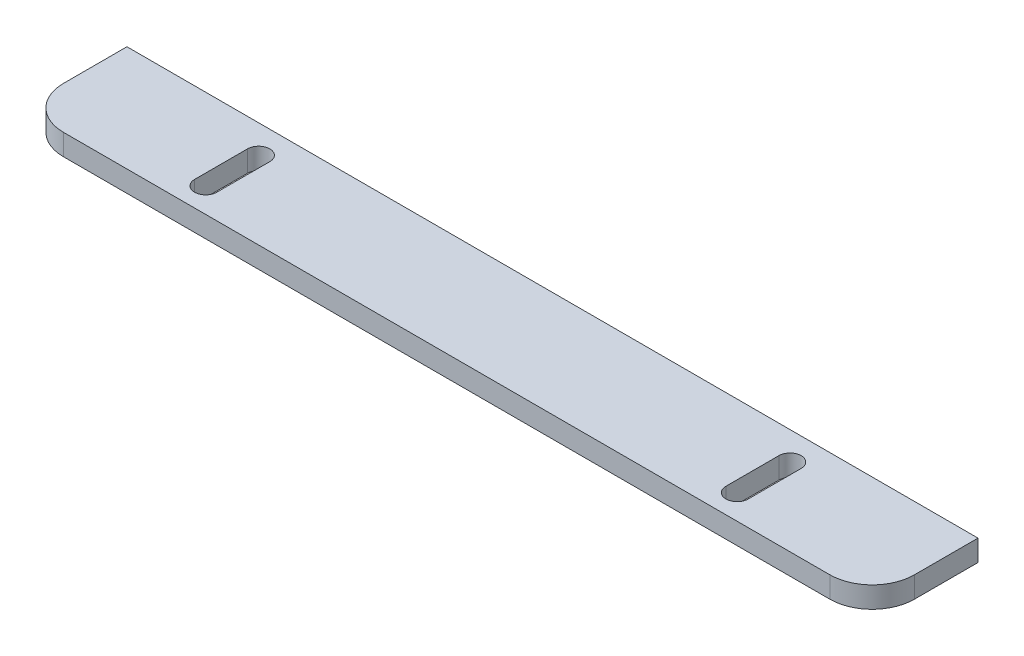
ISO-10303-21;
HEADER;
FILE_DESCRIPTION(('STEP AP214'),'2;1');
FILE_NAME('part.step','',(''),(''),'','','');
FILE_SCHEMA(('AUTOMOTIVE_DESIGN { 1 0 10303 214 1 1 1 1 }'));
ENDSEC;
DATA;
#1=APPLICATION_CONTEXT('core data for automotive mechanical design processes');
#2=APPLICATION_PROTOCOL_DEFINITION('international standard','automotive_design',2000,#1);
#3=PRODUCT_CONTEXT('',#1,'mechanical');
#4=PRODUCT('Part','Part','',(#3));
#5=PRODUCT_RELATED_PRODUCT_CATEGORY('part','',(#4));
#6=PRODUCT_DEFINITION_FORMATION('','',#4);
#7=PRODUCT_DEFINITION_CONTEXT('part definition',#1,'design');
#8=PRODUCT_DEFINITION('design','',#6,#7);
#9=PRODUCT_DEFINITION_SHAPE('','',#8);
#10=(LENGTH_UNIT() NAMED_UNIT(*) SI_UNIT(.MILLI.,.METRE.));
#11=(NAMED_UNIT(*) PLANE_ANGLE_UNIT() SI_UNIT($,.RADIAN.));
#12=(NAMED_UNIT(*) SI_UNIT($,.STERADIAN.) SOLID_ANGLE_UNIT());
#13=UNCERTAINTY_MEASURE_WITH_UNIT(LENGTH_MEASURE(1.E-05),#10,'distance_accuracy_value','');
#14=(GEOMETRIC_REPRESENTATION_CONTEXT(3) GLOBAL_UNCERTAINTY_ASSIGNED_CONTEXT((#13)) GLOBAL_UNIT_ASSIGNED_CONTEXT((#10,
#11,#12)) REPRESENTATION_CONTEXT('',''));
#15=CARTESIAN_POINT('',(0.,0.,0.));
#16=DIRECTION('',(0.,0.,1.));
#17=DIRECTION('',(1.,0.,0.));
#18=AXIS2_PLACEMENT_3D('',#15,#16,#17);
#19=CARTESIAN_POINT('',(10.,5.,-10.));
#20=DIRECTION('',(0.,-1.,0.));
#21=DIRECTION('',(0.,0.,-1.));
#22=AXIS2_PLACEMENT_3D('',#19,#20,#21);
#23=PLANE('',#22);
#24=CARTESIAN_POINT('',(37.75,5.,-18.3595406360424));
#25=DIRECTION('',(0.,1.,0.));
#26=DIRECTION('',(0.,0.,1.));
#27=AXIS2_PLACEMENT_3D('',#24,#25,#26);
#28=CIRCLE('',#27,2.62500000000001);
#29=CARTESIAN_POINT('',(40.375,5.,-18.3595406360424));
#30=VERTEX_POINT('',#29);
#31=CARTESIAN_POINT('',(35.125,5.,-18.3595406360424));
#32=VERTEX_POINT('',#31);
#33=EDGE_CURVE('E170',#30,#32,#28,.T.);
#34=ORIENTED_EDGE('',*,*,#33,.F.);
#35=DIRECTION('',(0.,0.,-1.));
#36=VECTOR('',#35,1.);
#37=CARTESIAN_POINT('',(40.375,5.,-18.3595406360424));
#38=LINE('',#37,#36);
#39=CARTESIAN_POINT('',(40.375,5.,-5.85954063604238));
#40=VERTEX_POINT('',#39);
#41=EDGE_CURVE('E178',#40,#30,#38,.T.);
#42=ORIENTED_EDGE('',*,*,#41,.F.);
#43=CARTESIAN_POINT('',(37.75,5.,-5.85954063604238));
#44=DIRECTION('',(0.,1.,0.));
#45=DIRECTION('',(0.,0.,1.));
#46=AXIS2_PLACEMENT_3D('',#43,#44,#45);
#47=CIRCLE('',#46,2.625);
#48=CARTESIAN_POINT('',(35.125,5.,-5.85954063604238));
#49=VERTEX_POINT('',#48);
#50=EDGE_CURVE('E175',#49,#40,#47,.T.);
#51=ORIENTED_EDGE('',*,*,#50,.F.);
#52=DIRECTION('',(0.,0.,1.));
#53=VECTOR('',#52,1.);
#54=CARTESIAN_POINT('',(35.125,5.,-18.3595406360424));
#55=LINE('',#54,#53);
#56=EDGE_CURVE('E172',#32,#49,#55,.T.);
#57=ORIENTED_EDGE('',*,*,#56,.F.);
#58=EDGE_LOOP('',(#34,#42,#51,#57));
#59=FACE_BOUND('',#58,.T.);
#60=DIRECTION('',(0.,0.,-1.));
#61=VECTOR('',#60,1.);
#62=CARTESIAN_POINT('',(201.,5.,-10.));
#63=LINE('',#62,#61);
#64=CARTESIAN_POINT('',(201.,5.,-10.));
#65=VERTEX_POINT('',#64);
#66=CARTESIAN_POINT('',(201.,5.,-25.));
#67=VERTEX_POINT('',#66);
#68=EDGE_CURVE('E201',#65,#67,#63,.T.);
#69=ORIENTED_EDGE('',*,*,#68,.T.);
#70=DIRECTION('',(-1.,0.,0.));
#71=VECTOR('',#70,1.);
#72=CARTESIAN_POINT('',(0.,5.,-25.));
#73=LINE('',#72,#71);
#74=CARTESIAN_POINT('',(0.,5.,-25.));
#75=VERTEX_POINT('',#74);
#76=EDGE_CURVE('E204',#67,#75,#73,.T.);
#77=ORIENTED_EDGE('',*,*,#76,.T.);
#78=DIRECTION('',(0.,0.,1.));
#79=VECTOR('',#78,1.);
#80=CARTESIAN_POINT('',(0.,5.,-10.));
#81=LINE('',#80,#79);
#82=CARTESIAN_POINT('',(0.,5.,-10.));
#83=VERTEX_POINT('',#82);
#84=EDGE_CURVE('E207',#75,#83,#81,.T.);
#85=ORIENTED_EDGE('',*,*,#84,.T.);
#86=CARTESIAN_POINT('',(10.,5.,-10.));
#87=DIRECTION('',(0.,1.,0.));
#88=DIRECTION('',(0.,0.,-1.));
#89=AXIS2_PLACEMENT_3D('',#86,#87,#88);
#90=CIRCLE('',#89,10.);
#91=CARTESIAN_POINT('',(10.,5.,0.));
#92=VERTEX_POINT('',#91);
#93=EDGE_CURVE('E209',#83,#92,#90,.T.);
#94=ORIENTED_EDGE('',*,*,#93,.T.);
#95=DIRECTION('',(1.,0.,0.));
#96=VECTOR('',#95,1.);
#97=CARTESIAN_POINT('',(10.,5.,0.));
#98=LINE('',#97,#96);
#99=CARTESIAN_POINT('',(191.,5.,0.));
#100=VERTEX_POINT('',#99);
#101=EDGE_CURVE('E211',#92,#100,#98,.T.);
#102=ORIENTED_EDGE('',*,*,#101,.T.);
#103=CARTESIAN_POINT('',(191.,5.,-10.));
#104=DIRECTION('',(0.,1.,0.));
#105=DIRECTION('',(0.,0.,1.));
#106=AXIS2_PLACEMENT_3D('',#103,#104,#105);
#107=CIRCLE('',#106,9.99999999999999);
#108=EDGE_CURVE('E213',#100,#65,#107,.T.);
#109=ORIENTED_EDGE('',*,*,#108,.T.);
#110=EDGE_LOOP('',(#69,#77,#85,#94,#102,#109));
#111=FACE_BOUND('',#110,.T.);
#112=CARTESIAN_POINT('',(163.25,5.,-18.3595406360424));
#113=DIRECTION('',(0.,1.,0.));
#114=DIRECTION('',(0.,0.,-1.));
#115=AXIS2_PLACEMENT_3D('',#112,#113,#114);
#116=CIRCLE('',#115,2.62500000000002);
#117=CARTESIAN_POINT('',(165.875,5.,-18.3595406360424));
#118=VERTEX_POINT('',#117);
#119=CARTESIAN_POINT('',(160.625,5.,-18.3595406360424));
#120=VERTEX_POINT('',#119);
#121=EDGE_CURVE('E134',#118,#120,#116,.T.);
#122=ORIENTED_EDGE('',*,*,#121,.F.);
#123=DIRECTION('',(0.,0.,-1.));
#124=VECTOR('',#123,1.);
#125=CARTESIAN_POINT('',(165.875,5.,-18.3595406360424));
#126=LINE('',#125,#124);
#127=CARTESIAN_POINT('',(165.875,5.,-5.85954063604238));
#128=VERTEX_POINT('',#127);
#129=EDGE_CURVE('E156',#128,#118,#126,.T.);
#130=ORIENTED_EDGE('',*,*,#129,.F.);
#131=CARTESIAN_POINT('',(163.25,5.,-5.85954063604238));
#132=DIRECTION('',(0.,1.,0.));
#133=DIRECTION('',(0.,0.,-1.));
#134=AXIS2_PLACEMENT_3D('',#131,#132,#133);
#135=CIRCLE('',#134,2.62499999999999);
#136=CARTESIAN_POINT('',(160.625,5.,-5.85954063604238));
#137=VERTEX_POINT('',#136);
#138=EDGE_CURVE('E154',#137,#128,#135,.T.);
#139=ORIENTED_EDGE('',*,*,#138,.F.);
#140=DIRECTION('',(0.,0.,1.));
#141=VECTOR('',#140,1.);
#142=CARTESIAN_POINT('',(160.625,5.,-18.3595406360424));
#143=LINE('',#142,#141);
#144=EDGE_CURVE('E142',#120,#137,#143,.T.);
#145=ORIENTED_EDGE('',*,*,#144,.F.);
#146=EDGE_LOOP('',(#122,#130,#139,#145));
#147=FACE_BOUND('',#146,.T.);
#148=ADVANCED_FACE('F33',(#59,#111,#147),#23,.F.);
#149=CARTESIAN_POINT('',(10.,0.,-10.));
#150=DIRECTION('',(0.,-1.,0.));
#151=DIRECTION('',(0.,0.,-1.));
#152=AXIS2_PLACEMENT_3D('',#149,#150,#151);
#153=PLANE('',#152);
#154=DIRECTION('',(0.,0.,-1.));
#155=VECTOR('',#154,1.);
#156=CARTESIAN_POINT('',(40.375,0.,-18.3595406360424));
#157=LINE('',#156,#155);
#158=CARTESIAN_POINT('',(40.375,0.,-5.85954063604238));
#159=VERTEX_POINT('',#158);
#160=CARTESIAN_POINT('',(40.375,0.,-18.3595406360424));
#161=VERTEX_POINT('',#160);
#162=EDGE_CURVE('E173',#159,#161,#157,.T.);
#163=ORIENTED_EDGE('',*,*,#162,.T.);
#164=CARTESIAN_POINT('',(37.75,0.,-18.3595406360424));
#165=DIRECTION('',(0.,1.,0.));
#166=DIRECTION('',(0.,0.,1.));
#167=AXIS2_PLACEMENT_3D('',#164,#165,#166);
#168=CIRCLE('',#167,2.62500000000001);
#169=CARTESIAN_POINT('',(35.125,0.,-18.3595406360424));
#170=VERTEX_POINT('',#169);
#171=EDGE_CURVE('E150',#161,#170,#168,.T.);
#172=ORIENTED_EDGE('',*,*,#171,.T.);
#173=DIRECTION('',(0.,0.,1.));
#174=VECTOR('',#173,1.);
#175=CARTESIAN_POINT('',(35.125,0.,-18.3595406360424));
#176=LINE('',#175,#174);
#177=CARTESIAN_POINT('',(35.125,0.,-5.85954063604238));
#178=VERTEX_POINT('',#177);
#179=EDGE_CURVE('E183',#170,#178,#176,.T.);
#180=ORIENTED_EDGE('',*,*,#179,.T.);
#181=CARTESIAN_POINT('',(37.75,0.,-5.85954063604238));
#182=DIRECTION('',(0.,1.,0.));
#183=DIRECTION('',(0.,0.,1.));
#184=AXIS2_PLACEMENT_3D('',#181,#182,#183);
#185=CIRCLE('',#184,2.625);
#186=EDGE_CURVE('E186',#178,#159,#185,.T.);
#187=ORIENTED_EDGE('',*,*,#186,.T.);
#188=EDGE_LOOP('',(#163,#172,#180,#187));
#189=FACE_BOUND('',#188,.T.);
#190=DIRECTION('',(0.,0.,-1.));
#191=VECTOR('',#190,1.);
#192=CARTESIAN_POINT('',(201.,0.,-10.));
#193=LINE('',#192,#191);
#194=CARTESIAN_POINT('',(201.,0.,-10.));
#195=VERTEX_POINT('',#194);
#196=CARTESIAN_POINT('',(201.,0.,-25.));
#197=VERTEX_POINT('',#196);
#198=EDGE_CURVE('E200',#195,#197,#193,.T.);
#199=ORIENTED_EDGE('',*,*,#198,.F.);
#200=CARTESIAN_POINT('',(191.,0.,-10.));
#201=DIRECTION('',(0.,1.,0.));
#202=DIRECTION('',(0.,0.,1.));
#203=AXIS2_PLACEMENT_3D('',#200,#201,#202);
#204=CIRCLE('',#203,9.99999999999999);
#205=CARTESIAN_POINT('',(191.,0.,0.));
#206=VERTEX_POINT('',#205);
#207=EDGE_CURVE('E205',#206,#195,#204,.T.);
#208=ORIENTED_EDGE('',*,*,#207,.F.);
#209=DIRECTION('',(1.,0.,0.));
#210=VECTOR('',#209,1.);
#211=CARTESIAN_POINT('',(10.,0.,0.));
#212=LINE('',#211,#210);
#213=CARTESIAN_POINT('',(10.,0.,0.));
#214=VERTEX_POINT('',#213);
#215=EDGE_CURVE('E224',#214,#206,#212,.T.);
#216=ORIENTED_EDGE('',*,*,#215,.F.);
#217=CARTESIAN_POINT('',(10.,0.,-10.));
#218=DIRECTION('',(0.,1.,0.));
#219=DIRECTION('',(0.,0.,-1.));
#220=AXIS2_PLACEMENT_3D('',#217,#218,#219);
#221=CIRCLE('',#220,10.);
#222=CARTESIAN_POINT('',(0.,0.,-10.));
#223=VERTEX_POINT('',#222);
#224=EDGE_CURVE('E222',#223,#214,#221,.T.);
#225=ORIENTED_EDGE('',*,*,#224,.F.);
#226=DIRECTION('',(0.,0.,1.));
#227=VECTOR('',#226,1.);
#228=CARTESIAN_POINT('',(0.,0.,-10.));
#229=LINE('',#228,#227);
#230=CARTESIAN_POINT('',(0.,0.,-25.));
#231=VERTEX_POINT('',#230);
#232=EDGE_CURVE('E220',#231,#223,#229,.T.);
#233=ORIENTED_EDGE('',*,*,#232,.F.);
#234=DIRECTION('',(-1.,0.,0.));
#235=VECTOR('',#234,1.);
#236=CARTESIAN_POINT('',(0.,0.,-25.));
#237=LINE('',#236,#235);
#238=EDGE_CURVE('E218',#197,#231,#237,.T.);
#239=ORIENTED_EDGE('',*,*,#238,.F.);
#240=EDGE_LOOP('',(#199,#208,#216,#225,#233,#239));
#241=FACE_BOUND('',#240,.T.);
#242=DIRECTION('',(0.,0.,-1.));
#243=VECTOR('',#242,1.);
#244=CARTESIAN_POINT('',(165.875,0.,-18.3595406360424));
#245=LINE('',#244,#243);
#246=CARTESIAN_POINT('',(165.875,0.,-5.85954063604238));
#247=VERTEX_POINT('',#246);
#248=CARTESIAN_POINT('',(165.875,0.,-18.3595406360424));
#249=VERTEX_POINT('',#248);
#250=EDGE_CURVE('E143',#247,#249,#245,.T.);
#251=ORIENTED_EDGE('',*,*,#250,.T.);
#252=CARTESIAN_POINT('',(163.25,0.,-18.3595406360424));
#253=DIRECTION('',(0.,1.,0.));
#254=DIRECTION('',(0.,0.,-1.));
#255=AXIS2_PLACEMENT_3D('',#252,#253,#254);
#256=CIRCLE('',#255,2.62500000000002);
#257=CARTESIAN_POINT('',(160.625,0.,-18.3595406360424));
#258=VERTEX_POINT('',#257);
#259=EDGE_CURVE('E56',#249,#258,#256,.T.);
#260=ORIENTED_EDGE('',*,*,#259,.T.);
#261=DIRECTION('',(0.,0.,1.));
#262=VECTOR('',#261,1.);
#263=CARTESIAN_POINT('',(160.625,0.,-18.3595406360424));
#264=LINE('',#263,#262);
#265=CARTESIAN_POINT('',(160.625,0.,-5.85954063604238));
#266=VERTEX_POINT('',#265);
#267=EDGE_CURVE('E149',#258,#266,#264,.T.);
#268=ORIENTED_EDGE('',*,*,#267,.T.);
#269=CARTESIAN_POINT('',(163.25,0.,-5.85954063604238));
#270=DIRECTION('',(0.,1.,0.));
#271=DIRECTION('',(0.,0.,-1.));
#272=AXIS2_PLACEMENT_3D('',#269,#270,#271);
#273=CIRCLE('',#272,2.62499999999999);
#274=EDGE_CURVE('E162',#266,#247,#273,.T.);
#275=ORIENTED_EDGE('',*,*,#274,.T.);
#276=EDGE_LOOP('',(#251,#260,#268,#275));
#277=FACE_BOUND('',#276,.T.);
#278=ADVANCED_FACE('F248',(#189,#241,#277),#153,.T.);
#279=CARTESIAN_POINT('',(201.,5.,-10.));
#280=DIRECTION('',(-1.,0.,0.));
#281=DIRECTION('',(0.,0.,1.));
#282=AXIS2_PLACEMENT_3D('',#279,#280,#281);
#283=PLANE('',#282);
#284=ORIENTED_EDGE('',*,*,#198,.T.);
#285=DIRECTION('',(0.,-1.,0.));
#286=VECTOR('',#285,1.);
#287=CARTESIAN_POINT('',(201.,5.,-25.));
#288=LINE('',#287,#286);
#289=EDGE_CURVE('E11',#67,#197,#288,.T.);
#290=ORIENTED_EDGE('',*,*,#289,.F.);
#291=ORIENTED_EDGE('',*,*,#68,.F.);
#292=DIRECTION('',(0.,-1.,0.));
#293=VECTOR('',#292,1.);
#294=CARTESIAN_POINT('',(201.,5.,-10.));
#295=LINE('',#294,#293);
#296=EDGE_CURVE('E215',#65,#195,#295,.T.);
#297=ORIENTED_EDGE('',*,*,#296,.T.);
#298=EDGE_LOOP('',(#284,#290,#291,#297));
#299=FACE_BOUND('',#298,.T.);
#300=ADVANCED_FACE('F35',(#299),#283,.F.);
#301=CARTESIAN_POINT('',(0.,5.,-25.));
#302=DIRECTION('',(0.,0.,1.));
#303=DIRECTION('',(1.,0.,0.));
#304=AXIS2_PLACEMENT_3D('',#301,#302,#303);
#305=PLANE('',#304);
#306=ORIENTED_EDGE('',*,*,#238,.T.);
#307=DIRECTION('',(0.,-1.,0.));
#308=VECTOR('',#307,1.);
#309=CARTESIAN_POINT('',(0.,5.,-25.));
#310=LINE('',#309,#308);
#311=EDGE_CURVE('E41',#75,#231,#310,.T.);
#312=ORIENTED_EDGE('',*,*,#311,.F.);
#313=ORIENTED_EDGE('',*,*,#76,.F.);
#314=ORIENTED_EDGE('',*,*,#289,.T.);
#315=EDGE_LOOP('',(#306,#312,#313,#314));
#316=FACE_BOUND('',#315,.T.);
#317=ADVANCED_FACE('F265',(#316),#305,.F.);
#318=CARTESIAN_POINT('',(0.,5.,-10.));
#319=DIRECTION('',(1.,0.,0.));
#320=DIRECTION('',(0.,0.,-1.));
#321=AXIS2_PLACEMENT_3D('',#318,#319,#320);
#322=PLANE('',#321);
#323=ORIENTED_EDGE('',*,*,#232,.T.);
#324=DIRECTION('',(0.,-1.,0.));
#325=VECTOR('',#324,1.);
#326=CARTESIAN_POINT('',(0.,5.,-10.));
#327=LINE('',#326,#325);
#328=EDGE_CURVE('E235',#83,#223,#327,.T.);
#329=ORIENTED_EDGE('',*,*,#328,.F.);
#330=ORIENTED_EDGE('',*,*,#84,.F.);
#331=ORIENTED_EDGE('',*,*,#311,.T.);
#332=EDGE_LOOP('',(#323,#329,#330,#331));
#333=FACE_BOUND('',#332,.T.);
#334=ADVANCED_FACE('F242',(#333),#322,.F.);
#335=CARTESIAN_POINT('',(10.,5.,-10.));
#336=DIRECTION('',(0.,-1.,0.));
#337=DIRECTION('',(0.,0.,-1.));
#338=AXIS2_PLACEMENT_3D('',#335,#336,#337);
#339=CYLINDRICAL_SURFACE('',#338,10.);
#340=ORIENTED_EDGE('',*,*,#224,.T.);
#341=DIRECTION('',(0.,-1.,0.));
#342=VECTOR('',#341,1.);
#343=CARTESIAN_POINT('',(10.,5.,0.));
#344=LINE('',#343,#342);
#345=EDGE_CURVE('E232',#92,#214,#344,.T.);
#346=ORIENTED_EDGE('',*,*,#345,.F.);
#347=ORIENTED_EDGE('',*,*,#93,.F.);
#348=ORIENTED_EDGE('',*,*,#328,.T.);
#349=EDGE_LOOP('',(#340,#346,#347,#348));
#350=FACE_BOUND('',#349,.T.);
#351=ADVANCED_FACE('F254',(#350),#339,.T.);
#352=CARTESIAN_POINT('',(10.,5.,0.));
#353=DIRECTION('',(0.,0.,-1.));
#354=DIRECTION('',(-1.,0.,0.));
#355=AXIS2_PLACEMENT_3D('',#352,#353,#354);
#356=PLANE('',#355);
#357=ORIENTED_EDGE('',*,*,#215,.T.);
#358=DIRECTION('',(0.,-1.,0.));
#359=VECTOR('',#358,1.);
#360=CARTESIAN_POINT('',(191.,5.,0.));
#361=LINE('',#360,#359);
#362=EDGE_CURVE('E229',#100,#206,#361,.T.);
#363=ORIENTED_EDGE('',*,*,#362,.F.);
#364=ORIENTED_EDGE('',*,*,#101,.F.);
#365=ORIENTED_EDGE('',*,*,#345,.T.);
#366=EDGE_LOOP('',(#357,#363,#364,#365));
#367=FACE_BOUND('',#366,.T.);
#368=ADVANCED_FACE('F258',(#367),#356,.F.);
#369=CARTESIAN_POINT('',(191.,5.,-10.));
#370=DIRECTION('',(0.,-1.,0.));
#371=DIRECTION('',(0.,0.,-1.));
#372=AXIS2_PLACEMENT_3D('',#369,#370,#371);
#373=CYLINDRICAL_SURFACE('',#372,9.99999999999999);
#374=ORIENTED_EDGE('',*,*,#207,.T.);
#375=ORIENTED_EDGE('',*,*,#296,.F.);
#376=ORIENTED_EDGE('',*,*,#108,.F.);
#377=ORIENTED_EDGE('',*,*,#362,.T.);
#378=EDGE_LOOP('',(#374,#375,#376,#377));
#379=FACE_BOUND('',#378,.T.);
#380=ADVANCED_FACE('F268',(#379),#373,.T.);
#381=CARTESIAN_POINT('',(37.75,5.,-18.3595406360424));
#382=DIRECTION('',(0.,-1.,0.));
#383=DIRECTION('',(0.,0.,-1.));
#384=AXIS2_PLACEMENT_3D('',#381,#382,#383);
#385=CYLINDRICAL_SURFACE('',#384,2.62500000000001);
#386=ORIENTED_EDGE('',*,*,#171,.F.);
#387=DIRECTION('',(0.,-1.,0.));
#388=VECTOR('',#387,1.);
#389=CARTESIAN_POINT('',(40.375,5.,-18.3595406360424));
#390=LINE('',#389,#388);
#391=EDGE_CURVE('E180',#30,#161,#390,.T.);
#392=ORIENTED_EDGE('',*,*,#391,.F.);
#393=ORIENTED_EDGE('',*,*,#33,.T.);
#394=DIRECTION('',(0.,-1.,0.));
#395=VECTOR('',#394,1.);
#396=CARTESIAN_POINT('',(35.125,5.,-18.3595406360424));
#397=LINE('',#396,#395);
#398=EDGE_CURVE('E197',#32,#170,#397,.T.);
#399=ORIENTED_EDGE('',*,*,#398,.T.);
#400=EDGE_LOOP('',(#386,#392,#393,#399));
#401=FACE_BOUND('',#400,.T.);
#402=ADVANCED_FACE('F270',(#401),#385,.F.);
#403=CARTESIAN_POINT('',(35.125,5.,-18.3595406360424));
#404=DIRECTION('',(1.,0.,0.));
#405=DIRECTION('',(0.,0.,-1.));
#406=AXIS2_PLACEMENT_3D('',#403,#404,#405);
#407=PLANE('',#406);
#408=ORIENTED_EDGE('',*,*,#179,.F.);
#409=ORIENTED_EDGE('',*,*,#398,.F.);
#410=ORIENTED_EDGE('',*,*,#56,.T.);
#411=DIRECTION('',(0.,-1.,0.));
#412=VECTOR('',#411,1.);
#413=CARTESIAN_POINT('',(35.125,5.,-5.85954063604238));
#414=LINE('',#413,#412);
#415=EDGE_CURVE('E195',#49,#178,#414,.T.);
#416=ORIENTED_EDGE('',*,*,#415,.T.);
#417=EDGE_LOOP('',(#408,#409,#410,#416));
#418=FACE_BOUND('',#417,.T.);
#419=ADVANCED_FACE('F276',(#418),#407,.T.);
#420=CARTESIAN_POINT('',(37.75,5.,-5.85954063604238));
#421=DIRECTION('',(0.,-1.,0.));
#422=DIRECTION('',(0.,0.,-1.));
#423=AXIS2_PLACEMENT_3D('',#420,#421,#422);
#424=CYLINDRICAL_SURFACE('',#423,2.625);
#425=ORIENTED_EDGE('',*,*,#186,.F.);
#426=ORIENTED_EDGE('',*,*,#415,.F.);
#427=ORIENTED_EDGE('',*,*,#50,.T.);
#428=DIRECTION('',(0.,-1.,0.));
#429=VECTOR('',#428,1.);
#430=CARTESIAN_POINT('',(40.375,5.,-5.85954063604238));
#431=LINE('',#430,#429);
#432=EDGE_CURVE('E193',#40,#159,#431,.T.);
#433=ORIENTED_EDGE('',*,*,#432,.T.);
#434=EDGE_LOOP('',(#425,#426,#427,#433));
#435=FACE_BOUND('',#434,.T.);
#436=ADVANCED_FACE('F292',(#435),#424,.F.);
#437=CARTESIAN_POINT('',(40.375,5.,-18.3595406360424));
#438=DIRECTION('',(-1.,0.,0.));
#439=DIRECTION('',(0.,0.,1.));
#440=AXIS2_PLACEMENT_3D('',#437,#438,#439);
#441=PLANE('',#440);
#442=ORIENTED_EDGE('',*,*,#162,.F.);
#443=ORIENTED_EDGE('',*,*,#432,.F.);
#444=ORIENTED_EDGE('',*,*,#41,.T.);
#445=ORIENTED_EDGE('',*,*,#391,.T.);
#446=EDGE_LOOP('',(#442,#443,#444,#445));
#447=FACE_BOUND('',#446,.T.);
#448=ADVANCED_FACE('F296',(#447),#441,.T.);
#449=CARTESIAN_POINT('',(163.25,5.,-18.3595406360424));
#450=DIRECTION('',(0.,-1.,0.));
#451=DIRECTION('',(0.,0.,-1.));
#452=AXIS2_PLACEMENT_3D('',#449,#450,#451);
#453=CYLINDRICAL_SURFACE('',#452,2.62500000000002);
#454=ORIENTED_EDGE('',*,*,#259,.F.);
#455=DIRECTION('',(0.,-1.,0.));
#456=VECTOR('',#455,1.);
#457=CARTESIAN_POINT('',(165.875,5.,-18.3595406360424));
#458=LINE('',#457,#456);
#459=EDGE_CURVE('E138',#118,#249,#458,.T.);
#460=ORIENTED_EDGE('',*,*,#459,.F.);
#461=ORIENTED_EDGE('',*,*,#121,.T.);
#462=DIRECTION('',(0.,-1.,0.));
#463=VECTOR('',#462,1.);
#464=CARTESIAN_POINT('',(160.625,5.,-18.3595406360424));
#465=LINE('',#464,#463);
#466=EDGE_CURVE('E137',#120,#258,#465,.T.);
#467=ORIENTED_EDGE('',*,*,#466,.T.);
#468=EDGE_LOOP('',(#454,#460,#461,#467));
#469=FACE_BOUND('',#468,.T.);
#470=ADVANCED_FACE('F136',(#469),#453,.F.);
#471=CARTESIAN_POINT('',(160.625,5.,-18.3595406360424));
#472=DIRECTION('',(1.,0.,0.));
#473=DIRECTION('',(0.,0.,-1.));
#474=AXIS2_PLACEMENT_3D('',#471,#472,#473);
#475=PLANE('',#474);
#476=ORIENTED_EDGE('',*,*,#267,.F.);
#477=ORIENTED_EDGE('',*,*,#466,.F.);
#478=ORIENTED_EDGE('',*,*,#144,.T.);
#479=DIRECTION('',(0.,-1.,0.));
#480=VECTOR('',#479,1.);
#481=CARTESIAN_POINT('',(160.625,5.,-5.85954063604238));
#482=LINE('',#481,#480);
#483=EDGE_CURVE('E151',#137,#266,#482,.T.);
#484=ORIENTED_EDGE('',*,*,#483,.T.);
#485=EDGE_LOOP('',(#476,#477,#478,#484));
#486=FACE_BOUND('',#485,.T.);
#487=ADVANCED_FACE('F146',(#486),#475,.T.);
#488=CARTESIAN_POINT('',(163.25,5.,-5.85954063604238));
#489=DIRECTION('',(0.,-1.,0.));
#490=DIRECTION('',(0.,0.,-1.));
#491=AXIS2_PLACEMENT_3D('',#488,#489,#490);
#492=CYLINDRICAL_SURFACE('',#491,2.62499999999999);
#493=ORIENTED_EDGE('',*,*,#274,.F.);
#494=ORIENTED_EDGE('',*,*,#483,.F.);
#495=ORIENTED_EDGE('',*,*,#138,.T.);
#496=DIRECTION('',(0.,-1.,0.));
#497=VECTOR('',#496,1.);
#498=CARTESIAN_POINT('',(165.875,5.,-5.85954063604238));
#499=LINE('',#498,#497);
#500=EDGE_CURVE('E48',#128,#247,#499,.T.);
#501=ORIENTED_EDGE('',*,*,#500,.T.);
#502=EDGE_LOOP('',(#493,#494,#495,#501));
#503=FACE_BOUND('',#502,.T.);
#504=ADVANCED_FACE('F305',(#503),#492,.F.);
#505=CARTESIAN_POINT('',(165.875,5.,-18.3595406360424));
#506=DIRECTION('',(-1.,0.,0.));
#507=DIRECTION('',(0.,0.,1.));
#508=AXIS2_PLACEMENT_3D('',#505,#506,#507);
#509=PLANE('',#508);
#510=ORIENTED_EDGE('',*,*,#250,.F.);
#511=ORIENTED_EDGE('',*,*,#500,.F.);
#512=ORIENTED_EDGE('',*,*,#129,.T.);
#513=ORIENTED_EDGE('',*,*,#459,.T.);
#514=EDGE_LOOP('',(#510,#511,#512,#513));
#515=FACE_BOUND('',#514,.T.);
#516=ADVANCED_FACE('F308',(#515),#509,.T.);
#517=CLOSED_SHELL('',(#148,#278,#300,#317,#334,#351,#368,#380,#402,#419,#436,#448,#470,#487,
#504,#516));
#518=MANIFOLD_SOLID_BREP('B2',#517);
#519=ADVANCED_BREP_SHAPE_REPRESENTATION('',(#18,#518),#14);
#520=SHAPE_DEFINITION_REPRESENTATION(#9,#519);
ENDSEC;
END-ISO-10303-21;
